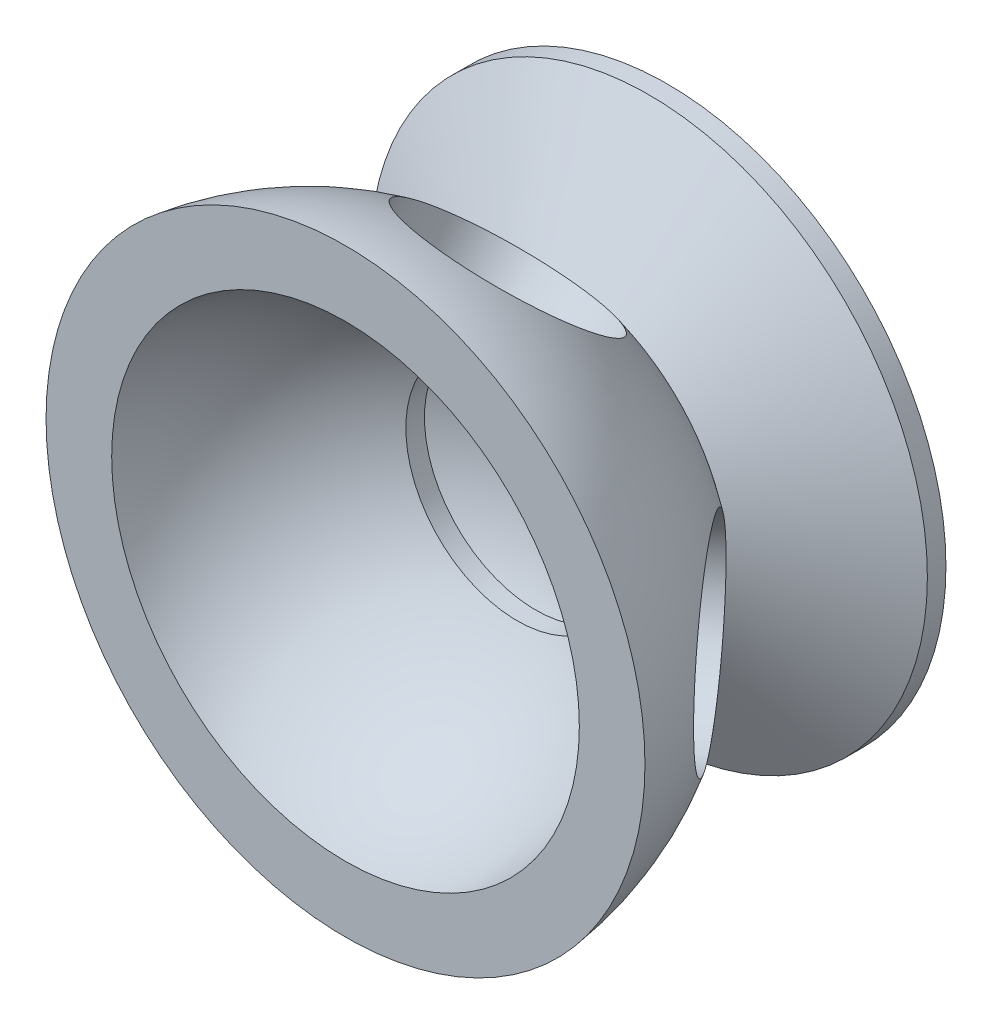
ISO-10303-21;
HEADER;
FILE_DESCRIPTION(('STEP AP214'),'2;1');
FILE_NAME('part.step','',(''),(''),'','','');
FILE_SCHEMA(('AUTOMOTIVE_DESIGN { 1 0 10303 214 1 1 1 1 }'));
ENDSEC;
DATA;
#1=APPLICATION_CONTEXT('core data for automotive mechanical design processes');
#2=APPLICATION_PROTOCOL_DEFINITION('international standard','automotive_design',2000,#1);
#3=PRODUCT_CONTEXT('',#1,'mechanical');
#4=PRODUCT('Part','Part','',(#3));
#5=PRODUCT_RELATED_PRODUCT_CATEGORY('part','',(#4));
#6=PRODUCT_DEFINITION_FORMATION('','',#4);
#7=PRODUCT_DEFINITION_CONTEXT('part definition',#1,'design');
#8=PRODUCT_DEFINITION('design','',#6,#7);
#9=PRODUCT_DEFINITION_SHAPE('','',#8);
#10=(LENGTH_UNIT() NAMED_UNIT(*) SI_UNIT(.MILLI.,.METRE.));
#11=(NAMED_UNIT(*) PLANE_ANGLE_UNIT() SI_UNIT($,.RADIAN.));
#12=(NAMED_UNIT(*) SI_UNIT($,.STERADIAN.) SOLID_ANGLE_UNIT());
#13=UNCERTAINTY_MEASURE_WITH_UNIT(LENGTH_MEASURE(1.E-05),#10,'distance_accuracy_value','');
#14=(GEOMETRIC_REPRESENTATION_CONTEXT(3) GLOBAL_UNCERTAINTY_ASSIGNED_CONTEXT((#13)) GLOBAL_UNIT_ASSIGNED_CONTEXT((#10,
#11,#12)) REPRESENTATION_CONTEXT('',''));
#15=CARTESIAN_POINT('',(0.,0.,0.));
#16=DIRECTION('',(0.,0.,1.));
#17=DIRECTION('',(1.,0.,0.));
#18=AXIS2_PLACEMENT_3D('',#15,#16,#17);
#19=CARTESIAN_POINT('',(0.,0.,0.));
#20=DIRECTION('',(0.,0.,1.));
#21=DIRECTION('',(1.,0.,0.));
#22=AXIS2_PLACEMENT_3D('',#19,#20,#21);
#23=SPHERICAL_SURFACE('',#22,16.25);
#24=CARTESIAN_POINT('',(-0.44185506858853,-12.5232501691859,-8.9440186324911));
#25=DIRECTION('',(0.0287002086426294,0.813433902405171,0.580948865599859));
#26=DIRECTION('',(0.,-0.581188277877603,0.813769123067265));
#27=AXIS2_PLACEMENT_3D('',#24,#25,#26);
#28=CIRCLE('',#27,5.2);
#29=CARTESIAN_POINT('',(-0.44185506858853,-9.50107112422237,-13.1756180724409));
#30=VERTEX_POINT('',#29);
#31=EDGE_CURVE('E39',#30,#30,#28,.F.);
#32=ORIENTED_EDGE('',*,*,#31,.F.);
#33=EDGE_LOOP('',(#32));
#34=FACE_BOUND('',#33,.T.);
#35=CARTESIAN_POINT('',(1.45728177982718,12.1963754773025,-9.28155455895387));
#36=DIRECTION('',(-0.094656130721202,-0.792202117315513,0.602873139422971));
#37=DIRECTION('',(0.,-0.6055922312598,-0.795775124917698));
#38=AXIS2_PLACEMENT_3D('',#35,#36,#37);
#39=CIRCLE('',#38,5.2);
#40=CARTESIAN_POINT('',(1.45728177982718,9.04729587475156,-13.4195852085259));
#41=VERTEX_POINT('',#40);
#42=EDGE_CURVE('E74',#41,#41,#39,.F.);
#43=ORIENTED_EDGE('',*,*,#42,.F.);
#44=EDGE_LOOP('',(#43));
#45=FACE_BOUND('',#44,.T.);
#46=CARTESIAN_POINT('',(0.,0.,-14.3352238082452));
#47=DIRECTION('',(0.,0.,1.));
#48=DIRECTION('',(1.,0.,0.));
#49=AXIS2_PLACEMENT_3D('',#46,#47,#48);
#50=CIRCLE('',#49,7.65270268385756);
#51=CARTESIAN_POINT('',(7.65270268385756,0.,-14.3352238082452));
#52=VERTEX_POINT('',#51);
#53=EDGE_CURVE('E78',#52,#52,#50,.T.);
#54=ORIENTED_EDGE('',*,*,#53,.T.);
#55=EDGE_LOOP('',(#54));
#56=FACE_BOUND('',#55,.T.);
#57=CARTESIAN_POINT('',(0.,0.,-2.));
#58=DIRECTION('',(0.,0.,1.));
#59=DIRECTION('',(1.,0.,0.));
#60=AXIS2_PLACEMENT_3D('',#57,#58,#59);
#61=CIRCLE('',#60,16.1264534228701);
#62=CARTESIAN_POINT('',(16.1264534228701,0.,-2.));
#63=VERTEX_POINT('',#62);
#64=EDGE_CURVE('E82',#63,#63,#61,.T.);
#65=ORIENTED_EDGE('',*,*,#64,.F.);
#66=EDGE_LOOP('',(#65));
#67=FACE_BOUND('',#66,.T.);
#68=CARTESIAN_POINT('',(12.0995384622019,-0.116539989223408,-9.51893310369443));
#69=DIRECTION('',(-0.785912175804609,0.00756972646394219,0.618291800983425));
#70=DIRECTION('',(0.618309516039402,0.,0.78593469345431));
#71=AXIS2_PLACEMENT_3D('',#68,#69,#70);
#72=CIRCLE('',#71,5.2);
#73=CARTESIAN_POINT('',(15.3147479456068,-0.116539989223408,-5.43207269773202));
#74=VERTEX_POINT('',#73);
#75=EDGE_CURVE('E86',#74,#74,#72,.F.);
#76=ORIENTED_EDGE('',*,*,#75,.F.);
#77=EDGE_LOOP('',(#76));
#78=FACE_BOUND('',#77,.T.);
#79=CARTESIAN_POINT('',(-12.0501028256839,-0.00705979749660364,-9.58214339538421));
#80=DIRECTION('',(0.782701138558889,0.000458561359892001,0.622397555763274));
#81=DIRECTION('',(0.622397621201703,0.,-0.782701220851521));
#82=AXIS2_PLACEMENT_3D('',#79,#80,#81);
#83=CIRCLE('',#82,5.2);
#84=CARTESIAN_POINT('',(-8.813635195435,-0.00705979749660364,-13.6521897438121));
#85=VERTEX_POINT('',#84);
#86=EDGE_CURVE('E89',#85,#85,#83,.F.);
#87=ORIENTED_EDGE('',*,*,#86,.F.);
#88=EDGE_LOOP('',(#87));
#89=FACE_BOUND('',#88,.T.);
#90=ADVANCED_FACE('F33',(#34,#45,#56,#67,#78,#89),#23,.T.);
#91=CARTESIAN_POINT('',(0.,0.,-14.3352238082452));
#92=DIRECTION('',(0.,0.,-1.));
#93=DIRECTION('',(-1.,0.,0.));
#94=AXIS2_PLACEMENT_3D('',#91,#92,#93);
#95=CONICAL_SURFACE('',#94,7.65270268385756,1.07224891500616);
#96=CARTESIAN_POINT('',(0.,0.,-18.3352238082452));
#97=DIRECTION('',(0.,0.,1.));
#98=DIRECTION('',(1.,0.,0.));
#99=AXIS2_PLACEMENT_3D('',#96,#97,#98);
#100=CIRCLE('',#99,15.);
#101=CARTESIAN_POINT('',(15.,0.,-18.3352238082452));
#102=VERTEX_POINT('',#101);
#103=EDGE_CURVE('E102',#102,#102,#100,.T.);
#104=ORIENTED_EDGE('',*,*,#103,.T.);
#105=EDGE_LOOP('',(#104));
#106=FACE_BOUND('',#105,.T.);
#107=ORIENTED_EDGE('',*,*,#53,.F.);
#108=EDGE_LOOP('',(#107));
#109=FACE_BOUND('',#108,.T.);
#110=ADVANCED_FACE('F60',(#106,#109),#95,.T.);
#111=CARTESIAN_POINT('',(0.,0.,0.));
#112=DIRECTION('',(0.,0.,1.));
#113=DIRECTION('',(1.,0.,0.));
#114=AXIS2_PLACEMENT_3D('',#111,#112,#113);
#115=CYLINDRICAL_SURFACE('',#114,15.);
#116=CARTESIAN_POINT('',(0.,0.,-19.3352238082452));
#117=DIRECTION('',(0.,0.,1.));
#118=DIRECTION('',(1.,0.,0.));
#119=AXIS2_PLACEMENT_3D('',#116,#117,#118);
#120=CIRCLE('',#119,15.);
#121=CARTESIAN_POINT('',(15.,0.,-19.3352238082452));
#122=VERTEX_POINT('',#121);
#123=EDGE_CURVE('E105',#122,#122,#120,.T.);
#124=ORIENTED_EDGE('',*,*,#123,.T.);
#125=EDGE_LOOP('',(#124));
#126=FACE_BOUND('',#125,.T.);
#127=ORIENTED_EDGE('',*,*,#103,.F.);
#128=EDGE_LOOP('',(#127));
#129=FACE_BOUND('',#128,.T.);
#130=ADVANCED_FACE('F65',(#126,#129),#115,.T.);
#131=CARTESIAN_POINT('',(3.5,0.,-19.3352238082452));
#132=DIRECTION('',(0.,0.,-1.));
#133=DIRECTION('',(-1.,0.,0.));
#134=AXIS2_PLACEMENT_3D('',#131,#132,#133);
#135=PLANE('',#134);
#136=CARTESIAN_POINT('',(0.,0.,-19.3352238082452));
#137=DIRECTION('',(0.,0.,1.));
#138=DIRECTION('',(1.,0.,0.));
#139=AXIS2_PLACEMENT_3D('',#136,#137,#138);
#140=CIRCLE('',#139,3.5);
#141=CARTESIAN_POINT('',(3.5,0.,-19.3352238082452));
#142=VERTEX_POINT('',#141);
#143=EDGE_CURVE('E108',#142,#142,#140,.T.);
#144=ORIENTED_EDGE('',*,*,#143,.T.);
#145=EDGE_LOOP('',(#144));
#146=FACE_BOUND('',#145,.T.);
#147=ORIENTED_EDGE('',*,*,#123,.F.);
#148=EDGE_LOOP('',(#147));
#149=FACE_BOUND('',#148,.T.);
#150=ADVANCED_FACE('F241',(#146,#149),#135,.T.);
#151=CARTESIAN_POINT('',(0.,0.,0.));
#152=DIRECTION('',(0.,0.,1.));
#153=DIRECTION('',(1.,0.,0.));
#154=AXIS2_PLACEMENT_3D('',#151,#152,#153);
#155=CYLINDRICAL_SURFACE('',#154,3.5);
#156=CARTESIAN_POINT('',(0.,0.,-20.8352238082452));
#157=DIRECTION('',(0.,0.,1.));
#158=DIRECTION('',(1.,0.,0.));
#159=AXIS2_PLACEMENT_3D('',#156,#157,#158);
#160=CIRCLE('',#159,3.5);
#161=CARTESIAN_POINT('',(3.5,0.,-20.8352238082452));
#162=VERTEX_POINT('',#161);
#163=EDGE_CURVE('E111',#162,#162,#160,.T.);
#164=ORIENTED_EDGE('',*,*,#163,.T.);
#165=EDGE_LOOP('',(#164));
#166=FACE_BOUND('',#165,.T.);
#167=ORIENTED_EDGE('',*,*,#143,.F.);
#168=EDGE_LOOP('',(#167));
#169=FACE_BOUND('',#168,.T.);
#170=ADVANCED_FACE('F55',(#166,#169),#155,.T.);
#171=CARTESIAN_POINT('',(0.,0.,-20.8352238082452));
#172=DIRECTION('',(0.,0.,-1.));
#173=DIRECTION('',(-1.,0.,0.));
#174=AXIS2_PLACEMENT_3D('',#171,#172,#173);
#175=PLANE('',#174);
#176=ORIENTED_EDGE('',*,*,#163,.F.);
#177=EDGE_LOOP('',(#176));
#178=FACE_BOUND('',#177,.T.);
#179=ADVANCED_FACE('F45',(#178),#175,.T.);
#180=CARTESIAN_POINT('',(-0.0540129987578299,0.,-0.183561975012202));
#181=DIRECTION('',(0.,-1.,0.));
#182=DIRECTION('',(1.,0.,0.));
#183=AXIS2_PLACEMENT_3D('',#180,#181,#182);
#184=CIRCLE('',#183,13.5);
#185=TRIMMED_CURVE('',#184,(PARAMETER_VALUE(-1.5667953532495)),
(PARAMETER_VALUE(1.5667953532495)),.T.,.PARAMETER.);
#186=CARTESIAN_POINT('',(0.,0.,-0.183561975012202));
#187=DIRECTION('',(0.,0.,1.));
#188=AXIS1_PLACEMENT('',#186,#187);
#189=SURFACE_OF_REVOLUTION('',#185,#188);
#190=CARTESIAN_POINT('',(0.,0.,-12.25));
#191=DIRECTION('',(0.,0.,1.));
#192=DIRECTION('',(1.,0.,0.));
#193=AXIS2_PLACEMENT_3D('',#190,#191,#192);
#194=CIRCLE('',#193,6.);
#195=CARTESIAN_POINT('',(6.,0.,-12.25));
#196=VERTEX_POINT('',#195);
#197=EDGE_CURVE('E114',#196,#196,#194,.T.);
#198=ORIENTED_EDGE('',*,*,#197,.T.);
#199=EDGE_LOOP('',(#198));
#200=FACE_BOUND('',#199,.T.);
#201=CARTESIAN_POINT('',(0.,0.,-13.6834539225785));
#202=VERTEX_POINT('',#201);
#203=VERTEX_LOOP('',#202);
#204=FACE_BOUND('',#203,.T.);
#205=ADVANCED_FACE('F42',(#200,#204),#189,.F.);
#206=CARTESIAN_POINT('',(0.,0.,0.));
#207=DIRECTION('',(0.,0.,1.));
#208=DIRECTION('',(1.,0.,0.));
#209=AXIS2_PLACEMENT_3D('',#206,#207,#208);
#210=CYLINDRICAL_SURFACE('',#209,6.);
#211=CARTESIAN_POINT('',(0.,0.,-11.25));
#212=DIRECTION('',(0.,0.,1.));
#213=DIRECTION('',(1.,0.,0.));
#214=AXIS2_PLACEMENT_3D('',#211,#212,#213);
#215=CIRCLE('',#214,6.);
#216=CARTESIAN_POINT('',(6.,0.,-11.25));
#217=VERTEX_POINT('',#216);
#218=EDGE_CURVE('E116',#217,#217,#215,.T.);
#219=ORIENTED_EDGE('',*,*,#218,.T.);
#220=EDGE_LOOP('',(#219));
#221=FACE_BOUND('',#220,.T.);
#222=ORIENTED_EDGE('',*,*,#197,.F.);
#223=EDGE_LOOP('',(#222));
#224=FACE_BOUND('',#223,.T.);
#225=ADVANCED_FACE('F44',(#221,#224),#210,.F.);
#226=CARTESIAN_POINT('',(0.,0.,0.));
#227=DIRECTION('',(0.,0.,1.));
#228=DIRECTION('',(1.,0.,0.));
#229=AXIS2_PLACEMENT_3D('',#226,#227,#228);
#230=SPHERICAL_SURFACE('',#229,12.75);
#231=CARTESIAN_POINT('',(0.,0.,-2.));
#232=DIRECTION('',(0.,0.,1.));
#233=DIRECTION('',(1.,0.,0.));
#234=AXIS2_PLACEMENT_3D('',#231,#232,#233);
#235=CIRCLE('',#234,12.592160259463);
#236=CARTESIAN_POINT('',(12.592160259463,0.,-2.));
#237=VERTEX_POINT('',#236);
#238=EDGE_CURVE('E119',#237,#237,#235,.T.);
#239=CARTESIAN_POINT('',(12.592160259463,0.,-2.));
#240=CARTESIAN_POINT('',(12.5729248265289,0.,-2.12111119773473));
#241=CARTESIAN_POINT('',(12.5519411065093,0.,-2.24194469004807));
#242=CARTESIAN_POINT('',(12.5064968438281,0.,-2.48295610140698));
#243=CARTESIAN_POINT('',(12.4820363011666,0.,-2.60313402045255));
#244=CARTESIAN_POINT('',(12.4296581447308,0.,-2.84273412285092));
#245=CARTESIAN_POINT('',(12.4017405309565,0.,-2.96215630620372));
#246=CARTESIAN_POINT('',(12.3424716373653,0.,-3.2001455501708));
#247=CARTESIAN_POINT('',(12.3111203575484,0.,-3.31871261078507));
#248=CARTESIAN_POINT('',(12.2450101876297,0.,-3.55489289492798));
#249=CARTESIAN_POINT('',(12.2102512975278,0.,-3.67250611845662));
#250=CARTESIAN_POINT('',(12.1373548552856,0.,-3.90668081864164));
#251=CARTESIAN_POINT('',(12.0992173031454,0.,-4.02324229529801));
#252=CARTESIAN_POINT('',(12.0195952828603,0.,-4.25521646470892));
#253=CARTESIAN_POINT('',(11.9781108147155,0.,-4.37062915746345));
#254=CARTESIAN_POINT('',(11.8918294987321,0.,-4.60020967914768));
#255=CARTESIAN_POINT('',(11.8470326508935,0.,-4.71437750807739));
#256=CARTESIAN_POINT('',(11.7541638682898,0.,-4.94137325832553));
#257=CARTESIAN_POINT('',(11.7060919335247,0.,-5.05420117964396));
#258=CARTESIAN_POINT('',(11.6067129966045,0.,-5.27842318639889));
#259=CARTESIAN_POINT('',(11.5554059944493,0.,-5.38981727183539));
#260=CARTESIAN_POINT('',(11.4495996353741,0.,-5.61107887219743));
#261=CARTESIAN_POINT('',(11.3951002784541,0.,-5.72094638712296));
#262=CARTESIAN_POINT('',(11.2829545801036,0.,-5.93906338269486));
#263=CARTESIAN_POINT('',(11.225308238673,0.,-6.04731286334123));
#264=CARTESIAN_POINT('',(11.1069165613876,0.,-6.26210367358527));
#265=CARTESIAN_POINT('',(11.0461712255327,0.,-6.36864500318294));
#266=CARTESIAN_POINT('',(10.9216321293731,0.,-6.57993081658154));
#267=CARTESIAN_POINT('',(10.8578383690682,0.,-6.68467530038246));
#268=CARTESIAN_POINT('',(10.7272555317698,0.,-6.89228022329823));
#269=CARTESIAN_POINT('',(10.6604664547762,0.,-6.99514066241307));
#270=CARTESIAN_POINT('',(10.5239485854372,0.,-7.19889186551848));
#271=CARTESIAN_POINT('',(10.4542197930918,0.,-7.29978262950905));
#272=CARTESIAN_POINT('',(10.3118805416739,0.,-7.49951049166547));
#273=CARTESIAN_POINT('',(10.2392700826015,0.,-7.59834758983133));
#274=CARTESIAN_POINT('',(10.0912279453175,0.,-7.79388583929715));
#275=CARTESIAN_POINT('',(10.015796267106,0.,-7.89058699059712));
#276=CARTESIAN_POINT('',(9.86217448777234,0.,-8.08177284344753));
#277=CARTESIAN_POINT('',(9.7839843866503,0.,-8.17625754499799));
#278=CARTESIAN_POINT('',(9.62491085408804,0.,-8.36293184064133));
#279=CARTESIAN_POINT('',(9.54402742264782,0.,-8.45512143473422));
#280=CARTESIAN_POINT('',(9.37963456421579,0.,-8.63712876841145));
#281=CARTESIAN_POINT('',(9.29612513722398,0.,-8.72694650799578));
#282=CARTESIAN_POINT('',(9.12654980857503,0.,-8.90413536015483));
#283=CARTESIAN_POINT('',(9.04048390691788,0.,-8.99150647272955));
#284=CARTESIAN_POINT('',(8.86586727806506,0.,-9.16372933515957));
#285=CARTESIAN_POINT('',(8.77731655086939,0.,-9.24858108501487));
#286=CARTESIAN_POINT('',(8.59780398867279,0.,-9.41569458366242));
#287=CARTESIAN_POINT('',(8.50684215367186,0.,-9.49795633245468));
#288=CARTESIAN_POINT('',(8.3225831007859,0.,-9.65982134671832));
#289=CARTESIAN_POINT('',(8.22928588290087,0.,-9.73942461218972));
#290=CARTESIAN_POINT('',(8.04043373349902,0.,-9.89590639097222));
#291=CARTESIAN_POINT('',(7.94487880198219,0.,-9.97278490428331));
#292=CARTESIAN_POINT('',(7.75159077355589,0.,-10.123753177292));
#293=CARTESIAN_POINT('',(7.65385767664641,0.,-10.1978429369896));
#294=CARTESIAN_POINT('',(7.45629468099528,0.,-10.3431720264647));
#295=CARTESIAN_POINT('',(7.35646478225364,0.,-10.4144113562422));
#296=CARTESIAN_POINT('',(7.15479128453983,0.,-10.5539802693439));
#297=CARTESIAN_POINT('',(7.05294768556767,0.,-10.6223098526681));
#298=CARTESIAN_POINT('',(6.84733159347942,0.,-10.7560024278767));
#299=CARTESIAN_POINT('',(6.74355910036333,0.,-10.821365419761));
#300=CARTESIAN_POINT('',(6.53417152700357,0.,-10.9490702531207));
#301=CARTESIAN_POINT('',(6.4285564467599,0.,-11.0114120945961));
#302=CARTESIAN_POINT('',(6.21557193143531,0.,-11.1330232686214));
#303=CARTESIAN_POINT('',(6.10820249635439,0.,-11.1922926011712));
#304=CARTESIAN_POINT('',(6.,0.,-11.25));
#305=B_SPLINE_CURVE_WITH_KNOTS('',3,(#239,#240,#241,#242,#243,#244,#245,#246,#247,#248,#249,
#250,#251,#252,#253,#254,#255,#256,#257,#258,#259,#260,#261,#262,#263,#264,#265,#266,#267,#268,
#269,#270,#271,#272,#273,#274,#275,#276,#277,#278,#279,#280,#281,#282,#283,#284,#285,#286,#287,
#288,#289,#290,#291,#292,#293,#294,#295,#296,#297,#298,#299,#300,#301,#302,#303,#304),
.UNSPECIFIED.,.F.,.F.,(4,2,2,2,2,2,2,2,2,2,2,2,2,2,2,2,2,2,2,2,2,2,2,2,2,2,2,2,2,2,2,2,4),(0.,
0.367874835550986,0.735749671101971,1.10362450665296,1.47149934220394,1.83937417775493,
2.20724901330591,2.5751238488569,2.94299868440789,3.31087351995887,3.67874835550986,
4.04662319106084,4.41449802661183,4.78237286216281,5.1502476977138,5.51812253326479,
5.88599736881577,6.25387220436676,6.62174703991774,6.98962187546873,7.35749671101972,
7.7253715465707,8.09324638212169,8.46112121767267,8.82899605322366,9.19687088877465,
9.56474572432563,9.93262055987661,10.3004953954276,10.6683702309786,11.0362450665296,
11.4041199020806,11.7719947376315),.UNSPECIFIED.);
#306=EDGE_CURVE('BSEAM52',#237,#217,#305,.T.);
#307=ORIENTED_EDGE('',*,*,#238,.T.);
#308=ORIENTED_EDGE('',*,*,#218,.F.);
#309=ORIENTED_EDGE('',*,*,#306,.T.);
#310=ORIENTED_EDGE('',*,*,#306,.F.);
#311=EDGE_LOOP('',(#307,#309,#308,#310));
#312=FACE_BOUND('',#311,.T.);
#313=ADVANCED_FACE('F52',(#312),#230,.F.);
#314=CARTESIAN_POINT('',(12.592160259463,0.,-2.));
#315=DIRECTION('',(0.,0.,1.));
#316=DIRECTION('',(1.,0.,0.));
#317=AXIS2_PLACEMENT_3D('',#314,#315,#316);
#318=PLANE('',#317);
#319=ORIENTED_EDGE('',*,*,#64,.T.);
#320=EDGE_LOOP('',(#319));
#321=FACE_BOUND('',#320,.T.);
#322=ORIENTED_EDGE('',*,*,#238,.F.);
#323=EDGE_LOOP('',(#322));
#324=FACE_BOUND('',#323,.T.);
#325=ADVANCED_FACE('F197',(#321,#324),#318,.T.);
#326=CARTESIAN_POINT('',(10.0989714590892,-0.0972709850616552,-7.94504964263701));
#327=DIRECTION('',(-0.785912175804609,0.00756972646394219,0.618291800983425));
#328=DIRECTION('',(0.618309516039402,0.,0.78593469345431));
#329=AXIS2_PLACEMENT_3D('',#326,#327,#328);
#330=PLANE('',#329);
#331=CARTESIAN_POINT('',(10.0989714590892,-0.0972709850616547,-7.94504964263701));
#332=DIRECTION('',(0.785912175804609,-0.00756972646394219,-0.618291800983425));
#333=DIRECTION('',(-0.618309516039402,0.,-0.78593469345431));
#334=AXIS2_PLACEMENT_3D('',#331,#332,#333);
#335=CIRCLE('',#334,5.2);
#336=CARTESIAN_POINT('',(6.88376197568433,-0.0972709850616547,-12.0319100485994));
#337=VERTEX_POINT('',#336);
#338=EDGE_CURVE('E100',#337,#337,#335,.T.);
#339=ORIENTED_EDGE('',*,*,#338,.T.);
#340=EDGE_LOOP('',(#339));
#341=FACE_BOUND('',#340,.T.);
#342=ADVANCED_FACE('F187',(#341),#330,.F.);
#343=CARTESIAN_POINT('',(12.5745948128737,-0.121115623423073,-9.8926688157348));
#344=DIRECTION('',(0.785912175804609,-0.00756972646394219,-0.618291800983425));
#345=DIRECTION('',(-0.618309516039402,0.,-0.78593469345431));
#346=AXIS2_PLACEMENT_3D('',#343,#344,#345);
#347=CYLINDRICAL_SURFACE('',#346,5.2);
#348=ORIENTED_EDGE('',*,*,#75,.T.);
#349=EDGE_LOOP('',(#348));
#350=FACE_BOUND('',#349,.T.);
#351=ORIENTED_EDGE('',*,*,#338,.F.);
#352=EDGE_LOOP('',(#351));
#353=FACE_BOUND('',#352,.T.);
#354=ADVANCED_FACE('F130',(#350,#353),#347,.F.);
#355=CARTESIAN_POINT('',(1.51449809153923,12.6752338770482,-9.64597023076754));
#356=DIRECTION('',(0.094656130721202,0.792202117315513,-0.602873139422971));
#357=DIRECTION('',(0.,0.6055922312598,0.795775124917698));
#358=AXIS2_PLACEMENT_3D('',#355,#356,#357);
#359=CYLINDRICAL_SURFACE('',#358,5.2);
#360=ORIENTED_EDGE('',*,*,#42,.T.);
#361=EDGE_LOOP('',(#360));
#362=FACE_BOUND('',#361,.T.);
#363=CARTESIAN_POINT('',(1.21633127976744,10.1797972075043,-7.74691984158518));
#364=DIRECTION('',(0.094656130721202,0.792202117315513,-0.602873139422971));
#365=DIRECTION('',(0.,0.6055922312598,0.795775124917698));
#366=AXIS2_PLACEMENT_3D('',#363,#364,#365);
#367=CIRCLE('',#366,5.2);
#368=CARTESIAN_POINT('',(1.21633127976744,13.3288768100553,-3.60888919201315));
#369=VERTEX_POINT('',#368);
#370=EDGE_CURVE('E94',#369,#369,#367,.T.);
#371=ORIENTED_EDGE('',*,*,#370,.F.);
#372=EDGE_LOOP('',(#371));
#373=FACE_BOUND('',#372,.T.);
#374=ADVANCED_FACE('F126',(#362,#373),#359,.F.);
#375=CARTESIAN_POINT('',(1.21633127976744,10.1797972075043,-7.74691984158518));
#376=DIRECTION('',(-0.094656130721202,-0.792202117315513,0.602873139422971));
#377=DIRECTION('',(0.,-0.6055922312598,-0.795775124917698));
#378=AXIS2_PLACEMENT_3D('',#375,#376,#377);
#379=PLANE('',#378);
#380=ORIENTED_EDGE('',*,*,#370,.T.);
#381=EDGE_LOOP('',(#380));
#382=FACE_BOUND('',#381,.T.);
#383=ADVANCED_FACE('F129',(#382),#379,.F.);
#384=CARTESIAN_POINT('',(-10.0577096304817,-0.0058925134746163,-7.99780859155807));
#385=DIRECTION('',(0.782701138558889,0.000458561359892001,0.622397555763274));
#386=DIRECTION('',(0.622397621201703,0.,-0.782701220851521));
#387=AXIS2_PLACEMENT_3D('',#384,#385,#386);
#388=PLANE('',#387);
#389=CARTESIAN_POINT('',(-10.0577096304817,-0.00589251347461582,-7.99780859155807));
#390=DIRECTION('',(-0.782701138558889,-0.000458561359892001,-0.622397555763274));
#391=DIRECTION('',(-0.622397621201703,0.,0.782701220851521));
#392=AXIS2_PLACEMENT_3D('',#389,#390,#391);
#393=CIRCLE('',#392,5.2);
#394=CARTESIAN_POINT('',(-13.2941772607306,-0.00589251347461582,-3.92776224313016));
#395=VERTEX_POINT('',#394);
#396=EDGE_CURVE('E91',#395,#395,#393,.T.);
#397=ORIENTED_EDGE('',*,*,#396,.T.);
#398=EDGE_LOOP('',(#397));
#399=FACE_BOUND('',#398,.T.);
#400=ADVANCED_FACE('F135',(#399),#388,.F.);
#401=CARTESIAN_POINT('',(-12.5232182169422,-0.00733698175827563,-9.95836089221238));
#402=DIRECTION('',(-0.782701138558889,-0.000458561359892001,-0.622397555763274));
#403=DIRECTION('',(-0.622397621201703,0.,0.782701220851521));
#404=AXIS2_PLACEMENT_3D('',#401,#402,#403);
#405=CYLINDRICAL_SURFACE('',#404,5.2);
#406=ORIENTED_EDGE('',*,*,#86,.T.);
#407=EDGE_LOOP('',(#406));
#408=FACE_BOUND('',#407,.T.);
#409=ORIENTED_EDGE('',*,*,#396,.F.);
#410=EDGE_LOOP('',(#409));
#411=FACE_BOUND('',#410,.T.);
#412=ADVANCED_FACE('F140',(#408,#411),#405,.F.);
#413=CARTESIAN_POINT('',(-0.459203338282063,-13.0149424384827,-9.29518184959775));
#414=DIRECTION('',(-0.0287002086426294,-0.813433902405171,-0.580948865599859));
#415=DIRECTION('',(0.,0.581188277877603,-0.813769123067265));
#416=AXIS2_PLACEMENT_3D('',#413,#414,#415);
#417=CYLINDRICAL_SURFACE('',#416,5.2);
#418=CARTESIAN_POINT('',(-0.36879768105778,-10.4526256459065,-7.46519292295819));
#419=DIRECTION('',(-0.0287002086426294,-0.813433902405171,-0.580948865599859));
#420=DIRECTION('',(0.,0.581188277877603,-0.813769123067265));
#421=AXIS2_PLACEMENT_3D('',#418,#419,#420);
#422=CIRCLE('',#421,5.2);
#423=CARTESIAN_POINT('',(-0.36879768105778,-7.43044660094292,-11.696792362908));
#424=VERTEX_POINT('',#423);
#425=EDGE_CURVE('E11',#424,#424,#422,.T.);
#426=CARTESIAN_POINT('',(-0.44185506858853,-9.50107112422237,-13.1756180724409));
#427=CARTESIAN_POINT('',(-0.441094054135085,-9.47950211877154,-13.1602136379666));
#428=CARTESIAN_POINT('',(-0.44033303968164,-9.45793311332071,-13.1448092034923));
#429=CARTESIAN_POINT('',(-0.438811010774749,-9.41479510241906,-13.1140003345437));
#430=CARTESIAN_POINT('',(-0.438049996321304,-9.39322609696823,-13.0985959000694));
#431=CARTESIAN_POINT('',(-0.436527967414413,-9.35008808606658,-13.0677870311208));
#432=CARTESIAN_POINT('',(-0.435766952960968,-9.32851908061575,-13.0523825966465));
#433=CARTESIAN_POINT('',(-0.434244924054077,-9.28538106971409,-13.0215737276979));
#434=CARTESIAN_POINT('',(-0.433483909600632,-9.26381206426327,-13.0061692932236));
#435=CARTESIAN_POINT('',(-0.431961880693741,-9.22067405336161,-12.975360424275));
#436=CARTESIAN_POINT('',(-0.431200866240296,-9.19910504791078,-12.9599559898007));
#437=CARTESIAN_POINT('',(-0.429678837333405,-9.15596703700913,-12.9291471208521));
#438=CARTESIAN_POINT('',(-0.42891782287996,-9.1343980315583,-12.9137426863778));
#439=CARTESIAN_POINT('',(-0.427395793973069,-9.09126002065664,-12.8829338174292));
#440=CARTESIAN_POINT('',(-0.426634779519624,-9.06969101520582,-12.8675293829549));
#441=CARTESIAN_POINT('',(-0.425112750612733,-9.02655300430416,-12.8367205140063));
#442=CARTESIAN_POINT('',(-0.424351736159288,-9.00498399885334,-12.821316079532));
#443=CARTESIAN_POINT('',(-0.422829707252397,-8.96184598795168,-12.7905072105834));
#444=CARTESIAN_POINT('',(-0.422068692798952,-8.94027698250085,-12.775102776109));
#445=CARTESIAN_POINT('',(-0.420546663892061,-8.8971389715992,-12.7442939071604));
#446=CARTESIAN_POINT('',(-0.419785649438616,-8.87556996614837,-12.7288894726861));
#447=CARTESIAN_POINT('',(-0.418263620531725,-8.83243195524671,-12.6980806037375));
#448=CARTESIAN_POINT('',(-0.41750260607828,-8.81086294979588,-12.6826761692632));
#449=CARTESIAN_POINT('',(-0.41598057717139,-8.76772493889423,-12.6518673003146));
#450=CARTESIAN_POINT('',(-0.415219562717944,-8.7461559334434,-12.6364628658403));
#451=CARTESIAN_POINT('',(-0.413697533811054,-8.70301792254175,-12.6056539968917));
#452=CARTESIAN_POINT('',(-0.412936519357608,-8.68144891709092,-12.5902495624174));
#453=CARTESIAN_POINT('',(-0.411414490450718,-8.63831090618926,-12.5594406934688));
#454=CARTESIAN_POINT('',(-0.410653475997272,-8.61674190073844,-12.5440362589945));
#455=CARTESIAN_POINT('',(-0.409131447090382,-8.57360388983678,-12.5132273900459));
#456=CARTESIAN_POINT('',(-0.408370432636936,-8.55203488438595,-12.4978229555716));
#457=CARTESIAN_POINT('',(-0.406848403730046,-8.5088968734843,-12.467014086623));
#458=CARTESIAN_POINT('',(-0.4060873892766,-8.48732786803347,-12.4516096521487));
#459=CARTESIAN_POINT('',(-0.40456536036971,-8.44418985713181,-12.4208007832001));
#460=CARTESIAN_POINT('',(-0.403804345916265,-8.42262085168099,-12.4053963487258));
#461=CARTESIAN_POINT('',(-0.402282317009374,-8.37948284077933,-12.3745874797772));
#462=CARTESIAN_POINT('',(-0.401521302555928,-8.3579138353285,-12.3591830453029));
#463=CARTESIAN_POINT('',(-0.399999273649038,-8.31477582442685,-12.3283741763543));
#464=CARTESIAN_POINT('',(-0.399238259195593,-8.29320681897602,-12.31296974188));
#465=CARTESIAN_POINT('',(-0.397716230288702,-8.25006880807437,-12.2821608729314));
#466=CARTESIAN_POINT('',(-0.396955215835257,-8.22849980262354,-12.2667564384571));
#467=CARTESIAN_POINT('',(-0.395433186928366,-8.18536179172188,-12.2359475695085));
#468=CARTESIAN_POINT('',(-0.394672172474921,-8.16379278627106,-12.2205431350342));
#469=CARTESIAN_POINT('',(-0.39315014356803,-8.1206547753694,-12.1897342660856));
#470=CARTESIAN_POINT('',(-0.392389129114585,-8.09908576991857,-12.1743298316113));
#471=CARTESIAN_POINT('',(-0.390867100207694,-8.05594775901692,-12.1435209626627));
#472=CARTESIAN_POINT('',(-0.390106085754249,-8.03437875356609,-12.1281165281884));
#473=CARTESIAN_POINT('',(-0.388584056847358,-7.99124074266444,-12.0973076592398));
#474=CARTESIAN_POINT('',(-0.387823042393913,-7.96967173721361,-12.0819032247655));
#475=CARTESIAN_POINT('',(-0.386301013487022,-7.92653372631195,-12.0510943558169));
#476=CARTESIAN_POINT('',(-0.385539999033577,-7.90496472086113,-12.0356899213426));
#477=CARTESIAN_POINT('',(-0.384017970126686,-7.86182670995947,-12.004881052394));
#478=CARTESIAN_POINT('',(-0.383256955673241,-7.84025770450864,-11.9894766179197));
#479=CARTESIAN_POINT('',(-0.38173492676635,-7.79711969360699,-11.9586677489711));
#480=CARTESIAN_POINT('',(-0.380973912312905,-7.77555068815616,-11.9432633144968));
#481=CARTESIAN_POINT('',(-0.379451883406014,-7.7324126772545,-11.9124544455482));
#482=CARTESIAN_POINT('',(-0.378690868952569,-7.71084367180368,-11.8970500110739));
#483=CARTESIAN_POINT('',(-0.377168840045678,-7.66770566090202,-11.8662411421253));
#484=CARTESIAN_POINT('',(-0.376407825592233,-7.64613665545119,-11.850836707651));
#485=CARTESIAN_POINT('',(-0.374885796685342,-7.60299864454954,-11.8200278387024));
#486=CARTESIAN_POINT('',(-0.374124782231897,-7.58142963909871,-11.8046234042281));
#487=CARTESIAN_POINT('',(-0.372602753325006,-7.53829162819706,-11.7738145352795));
#488=CARTESIAN_POINT('',(-0.371841738871561,-7.51672262274623,-11.7584101008052));
#489=CARTESIAN_POINT('',(-0.37031970996467,-7.47358461184457,-11.7276012318566));
#490=CARTESIAN_POINT('',(-0.369558695511225,-7.45201560639374,-11.7121967973823));
#491=CARTESIAN_POINT('',(-0.36879768105778,-7.43044660094292,-11.696792362908));
#492=B_SPLINE_CURVE_WITH_KNOTS('',3,(#426,#427,#428,#429,#430,#431,#432,#433,#434,#435,#436,
#437,#438,#439,#440,#441,#442,#443,#444,#445,#446,#447,#448,#449,#450,#451,#452,#453,#454,#455,
#456,#457,#458,#459,#460,#461,#462,#463,#464,#465,#466,#467,#468,#469,#470,#471,#472,#473,#474,
#475,#476,#477,#478,#479,#480,#481,#482,#483,#484,#485,#486,#487,#488,#489,#490,#491),
.UNSPECIFIED.,.F.,.F.,(4,2,2,2,2,2,2,2,2,2,2,2,2,2,2,2,2,2,2,2,2,2,2,2,2,2,2,2,2,2,2,2,4),(0.,
0.0795479708445359,0.15909594168907,0.238643912533606,0.31819188337814,0.397739854222675,
0.477287825067211,0.556835795911745,0.636383766756281,0.715931737600815,0.795479708445351,
0.875027679289885,0.95457565013442,1.03412362097896,1.11367159182349,1.19321956266803,
1.27276753351256,1.3523155043571,1.43186347520163,1.51141144604617,1.5909594168907,
1.67050738773523,1.75005535857977,1.8296033294243,1.90915130026884,1.98869927111338,
2.06824724195791,2.14779521280245,2.22734318364698,2.30689115449152,2.38643912533605,
2.46598709618058,2.54553506702512),.UNSPECIFIED.);
#493=EDGE_CURVE('BSEAM144',#30,#424,#492,.T.);
#494=ORIENTED_EDGE('',*,*,#31,.T.);
#495=ORIENTED_EDGE('',*,*,#425,.F.);
#496=ORIENTED_EDGE('',*,*,#493,.T.);
#497=ORIENTED_EDGE('',*,*,#493,.F.);
#498=EDGE_LOOP('',(#494,#496,#495,#497));
#499=FACE_BOUND('',#498,.T.);
#500=ADVANCED_FACE('F144',(#499),#417,.F.);
#501=CARTESIAN_POINT('',(-0.36879768105778,-10.4526256459065,-7.4651929229582));
#502=DIRECTION('',(0.0287002086426294,0.813433902405171,0.580948865599859));
#503=DIRECTION('',(0.,-0.581188277877603,0.813769123067265));
#504=AXIS2_PLACEMENT_3D('',#501,#502,#503);
#505=PLANE('',#504);
#506=ORIENTED_EDGE('',*,*,#425,.T.);
#507=EDGE_LOOP('',(#506));
#508=FACE_BOUND('',#507,.T.);
#509=ADVANCED_FACE('F146',(#508),#505,.F.);
#510=CLOSED_SHELL('',(#90,#110,#130,#150,#170,#179,#205,#225,#313,#325,#342,#354,#374,#383,#400,
#412,#500,#509));
#511=MANIFOLD_SOLID_BREP('B2',#510);
#512=ADVANCED_BREP_SHAPE_REPRESENTATION('',(#18,#511),#14);
#513=SHAPE_DEFINITION_REPRESENTATION(#9,#512);
ENDSEC;
END-ISO-10303-21;
